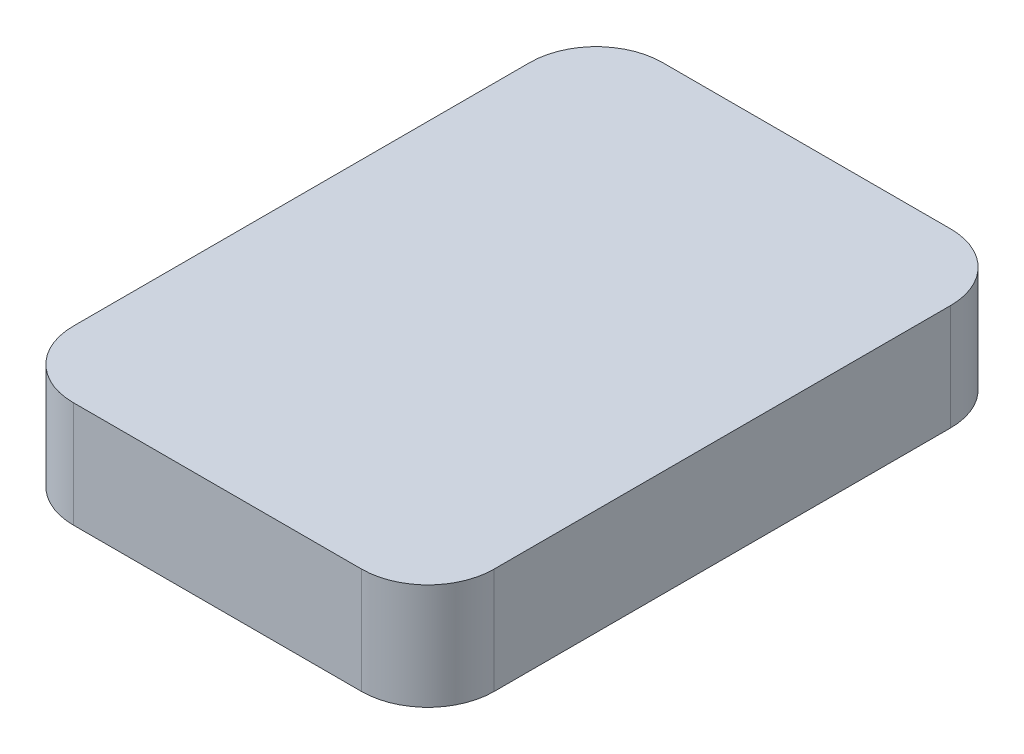
ISO-10303-21;
HEADER;
FILE_DESCRIPTION(('STEP AP214'),'2;1');
FILE_NAME('part.step','',(''),(''),'','','');
FILE_SCHEMA(('AUTOMOTIVE_DESIGN { 1 0 10303 214 1 1 1 1 }'));
ENDSEC;
DATA;
#1=APPLICATION_CONTEXT('core data for automotive mechanical design processes');
#2=APPLICATION_PROTOCOL_DEFINITION('international standard','automotive_design',2000,#1);
#3=PRODUCT_CONTEXT('',#1,'mechanical');
#4=PRODUCT('Part','Part','',(#3));
#5=PRODUCT_RELATED_PRODUCT_CATEGORY('part','',(#4));
#6=PRODUCT_DEFINITION_FORMATION('','',#4);
#7=PRODUCT_DEFINITION_CONTEXT('part definition',#1,'design');
#8=PRODUCT_DEFINITION('design','',#6,#7);
#9=PRODUCT_DEFINITION_SHAPE('','',#8);
#10=(LENGTH_UNIT() NAMED_UNIT(*) SI_UNIT(.MILLI.,.METRE.));
#11=(NAMED_UNIT(*) PLANE_ANGLE_UNIT() SI_UNIT($,.RADIAN.));
#12=(NAMED_UNIT(*) SI_UNIT($,.STERADIAN.) SOLID_ANGLE_UNIT());
#13=UNCERTAINTY_MEASURE_WITH_UNIT(LENGTH_MEASURE(1.E-05),#10,'distance_accuracy_value','');
#14=(GEOMETRIC_REPRESENTATION_CONTEXT(3) GLOBAL_UNCERTAINTY_ASSIGNED_CONTEXT((#13)) GLOBAL_UNIT_ASSIGNED_CONTEXT((#10,
#11,#12)) REPRESENTATION_CONTEXT('',''));
#15=CARTESIAN_POINT('',(0.,0.,0.));
#16=DIRECTION('',(0.,0.,1.));
#17=DIRECTION('',(1.,0.,0.));
#18=AXIS2_PLACEMENT_3D('',#15,#16,#17);
#19=CARTESIAN_POINT('',(31.75,16.,44.45));
#20=DIRECTION('',(-1.,0.,0.));
#21=DIRECTION('',(0.,0.,1.));
#22=AXIS2_PLACEMENT_3D('',#19,#20,#21);
#23=PLANE('',#22);
#24=DIRECTION('',(0.,0.,-1.));
#25=VECTOR('',#24,1.);
#26=CARTESIAN_POINT('',(31.75,16.,44.45));
#27=LINE('',#26,#25);
#28=CARTESIAN_POINT('',(31.75,16.,34.45));
#29=VERTEX_POINT('',#28);
#30=CARTESIAN_POINT('',(31.75,16.,-34.45));
#31=VERTEX_POINT('',#30);
#32=EDGE_CURVE('E119',#29,#31,#27,.T.);
#33=ORIENTED_EDGE('',*,*,#32,.F.);
#34=DIRECTION('',(0.,-1.,0.));
#35=VECTOR('',#34,1.);
#36=CARTESIAN_POINT('',(31.75,16.,34.45));
#37=LINE('',#36,#35);
#38=CARTESIAN_POINT('',(31.75,0.,34.45));
#39=VERTEX_POINT('',#38);
#40=EDGE_CURVE('E104',#29,#39,#37,.T.);
#41=ORIENTED_EDGE('',*,*,#40,.T.);
#42=DIRECTION('',(0.,0.,-1.));
#43=VECTOR('',#42,1.);
#44=CARTESIAN_POINT('',(31.75,0.,44.45));
#45=LINE('',#44,#43);
#46=CARTESIAN_POINT('',(31.75,0.,-34.45));
#47=VERTEX_POINT('',#46);
#48=EDGE_CURVE('E116',#39,#47,#45,.T.);
#49=ORIENTED_EDGE('',*,*,#48,.T.);
#50=DIRECTION('',(0.,-1.,0.));
#51=VECTOR('',#50,1.);
#52=CARTESIAN_POINT('',(31.75,16.,-34.45));
#53=LINE('',#52,#51);
#54=EDGE_CURVE('E121',#47,#31,#53,.F.);
#55=ORIENTED_EDGE('',*,*,#54,.T.);
#56=EDGE_LOOP('',(#33,#41,#49,#55));
#57=FACE_BOUND('',#56,.T.);
#58=ADVANCED_FACE('F34',(#57),#23,.F.);
#59=CARTESIAN_POINT('',(-31.75,16.,-44.45));
#60=DIRECTION('',(0.,0.,1.));
#61=DIRECTION('',(1.,0.,0.));
#62=AXIS2_PLACEMENT_3D('',#59,#60,#61);
#63=PLANE('',#62);
#64=DIRECTION('',(-1.,0.,0.));
#65=VECTOR('',#64,1.);
#66=CARTESIAN_POINT('',(-31.75,16.,-44.45));
#67=LINE('',#66,#65);
#68=CARTESIAN_POINT('',(21.75,16.,-44.45));
#69=VERTEX_POINT('',#68);
#70=CARTESIAN_POINT('',(-21.75,16.,-44.45));
#71=VERTEX_POINT('',#70);
#72=EDGE_CURVE('E161',#69,#71,#67,.T.);
#73=ORIENTED_EDGE('',*,*,#72,.F.);
#74=DIRECTION('',(0.,-1.,0.));
#75=VECTOR('',#74,1.);
#76=CARTESIAN_POINT('',(21.75,16.,-44.45));
#77=LINE('',#76,#75);
#78=CARTESIAN_POINT('',(21.75,0.,-44.45));
#79=VERTEX_POINT('',#78);
#80=EDGE_CURVE('E154',#69,#79,#77,.T.);
#81=ORIENTED_EDGE('',*,*,#80,.T.);
#82=DIRECTION('',(-1.,0.,0.));
#83=VECTOR('',#82,1.);
#84=CARTESIAN_POINT('',(-31.75,0.,-44.45));
#85=LINE('',#84,#83);
#86=CARTESIAN_POINT('',(-21.75,0.,-44.45));
#87=VERTEX_POINT('',#86);
#88=EDGE_CURVE('E125',#79,#87,#85,.T.);
#89=ORIENTED_EDGE('',*,*,#88,.T.);
#90=DIRECTION('',(0.,-1.,0.));
#91=VECTOR('',#90,1.);
#92=CARTESIAN_POINT('',(-21.75,16.,-44.45));
#93=LINE('',#92,#91);
#94=EDGE_CURVE('E152',#87,#71,#93,.F.);
#95=ORIENTED_EDGE('',*,*,#94,.T.);
#96=EDGE_LOOP('',(#73,#81,#89,#95));
#97=FACE_BOUND('',#96,.T.);
#98=ADVANCED_FACE('F159',(#97),#63,.F.);
#99=CARTESIAN_POINT('',(-31.75,16.,44.45));
#100=DIRECTION('',(1.,0.,0.));
#101=DIRECTION('',(0.,0.,-1.));
#102=AXIS2_PLACEMENT_3D('',#99,#100,#101);
#103=PLANE('',#102);
#104=DIRECTION('',(0.,0.,1.));
#105=VECTOR('',#104,1.);
#106=CARTESIAN_POINT('',(-31.75,16.,44.45));
#107=LINE('',#106,#105);
#108=CARTESIAN_POINT('',(-31.75,16.,-34.45));
#109=VERTEX_POINT('',#108);
#110=CARTESIAN_POINT('',(-31.75,16.,34.45));
#111=VERTEX_POINT('',#110);
#112=EDGE_CURVE('E169',#109,#111,#107,.T.);
#113=ORIENTED_EDGE('',*,*,#112,.F.);
#114=DIRECTION('',(0.,-1.,0.));
#115=VECTOR('',#114,1.);
#116=CARTESIAN_POINT('',(-31.75,16.,-34.45));
#117=LINE('',#116,#115);
#118=CARTESIAN_POINT('',(-31.75,0.,-34.45));
#119=VERTEX_POINT('',#118);
#120=EDGE_CURVE('E11',#109,#119,#117,.T.);
#121=ORIENTED_EDGE('',*,*,#120,.T.);
#122=DIRECTION('',(0.,0.,1.));
#123=VECTOR('',#122,1.);
#124=CARTESIAN_POINT('',(-31.75,0.,44.45));
#125=LINE('',#124,#123);
#126=CARTESIAN_POINT('',(-31.75,0.,34.45));
#127=VERTEX_POINT('',#126);
#128=EDGE_CURVE('E128',#119,#127,#125,.T.);
#129=ORIENTED_EDGE('',*,*,#128,.T.);
#130=DIRECTION('',(0.,-1.,0.));
#131=VECTOR('',#130,1.);
#132=CARTESIAN_POINT('',(-31.75,16.,34.45));
#133=LINE('',#132,#131);
#134=EDGE_CURVE('E42',#127,#111,#133,.F.);
#135=ORIENTED_EDGE('',*,*,#134,.T.);
#136=EDGE_LOOP('',(#113,#121,#129,#135));
#137=FACE_BOUND('',#136,.T.);
#138=ADVANCED_FACE('F168',(#137),#103,.F.);
#139=CARTESIAN_POINT('',(-31.75,16.,44.45));
#140=DIRECTION('',(0.,0.,-1.));
#141=DIRECTION('',(-1.,0.,0.));
#142=AXIS2_PLACEMENT_3D('',#139,#140,#141);
#143=PLANE('',#142);
#144=DIRECTION('',(1.,0.,0.));
#145=VECTOR('',#144,1.);
#146=CARTESIAN_POINT('',(-31.75,0.,44.45));
#147=LINE('',#146,#145);
#148=CARTESIAN_POINT('',(-21.75,0.,44.45));
#149=VERTEX_POINT('',#148);
#150=CARTESIAN_POINT('',(21.75,0.,44.45));
#151=VERTEX_POINT('',#150);
#152=EDGE_CURVE('E135',#149,#151,#147,.T.);
#153=ORIENTED_EDGE('',*,*,#152,.T.);
#154=DIRECTION('',(0.,-1.,0.));
#155=VECTOR('',#154,1.);
#156=CARTESIAN_POINT('',(21.75,16.,44.45));
#157=LINE('',#156,#155);
#158=CARTESIAN_POINT('',(21.75,16.,44.45));
#159=VERTEX_POINT('',#158);
#160=EDGE_CURVE('E105',#151,#159,#157,.F.);
#161=ORIENTED_EDGE('',*,*,#160,.T.);
#162=DIRECTION('',(1.,0.,0.));
#163=VECTOR('',#162,1.);
#164=CARTESIAN_POINT('',(-31.75,16.,44.45));
#165=LINE('',#164,#163);
#166=CARTESIAN_POINT('',(-21.75,16.,44.45));
#167=VERTEX_POINT('',#166);
#168=EDGE_CURVE('E131',#167,#159,#165,.T.);
#169=ORIENTED_EDGE('',*,*,#168,.F.);
#170=DIRECTION('',(0.,-1.,0.));
#171=VECTOR('',#170,1.);
#172=CARTESIAN_POINT('',(-21.75,16.,44.45));
#173=LINE('',#172,#171);
#174=EDGE_CURVE('E110',#167,#149,#173,.T.);
#175=ORIENTED_EDGE('',*,*,#174,.T.);
#176=EDGE_LOOP('',(#153,#161,#169,#175));
#177=FACE_BOUND('',#176,.T.);
#178=ADVANCED_FACE('F192',(#177),#143,.F.);
#179=CARTESIAN_POINT('',(0.,16.,0.));
#180=DIRECTION('',(0.,-1.,0.));
#181=DIRECTION('',(0.,0.,-1.));
#182=AXIS2_PLACEMENT_3D('',#179,#180,#181);
#183=PLANE('',#182);
#184=ORIENTED_EDGE('',*,*,#168,.T.);
#185=CARTESIAN_POINT('',(21.75,16.,34.45));
#186=DIRECTION('',(0.,-1.,0.));
#187=DIRECTION('',(0.,0.,-1.));
#188=AXIS2_PLACEMENT_3D('',#185,#186,#187);
#189=CIRCLE('',#188,10.);
#190=EDGE_CURVE('E150',#159,#29,#189,.F.);
#191=ORIENTED_EDGE('',*,*,#190,.T.);
#192=ORIENTED_EDGE('',*,*,#32,.T.);
#193=CARTESIAN_POINT('',(21.75,16.,-34.45));
#194=DIRECTION('',(0.,-1.,0.));
#195=DIRECTION('',(0.,0.,-1.));
#196=AXIS2_PLACEMENT_3D('',#193,#194,#195);
#197=CIRCLE('',#196,10.);
#198=EDGE_CURVE('E148',#31,#69,#197,.F.);
#199=ORIENTED_EDGE('',*,*,#198,.T.);
#200=ORIENTED_EDGE('',*,*,#72,.T.);
#201=CARTESIAN_POINT('',(-21.75,16.,-34.45));
#202=DIRECTION('',(0.,-1.,0.));
#203=DIRECTION('',(0.,0.,-1.));
#204=AXIS2_PLACEMENT_3D('',#201,#202,#203);
#205=CIRCLE('',#204,10.);
#206=EDGE_CURVE('E55',#71,#109,#205,.F.);
#207=ORIENTED_EDGE('',*,*,#206,.T.);
#208=ORIENTED_EDGE('',*,*,#112,.T.);
#209=CARTESIAN_POINT('',(-21.75,16.,34.45));
#210=DIRECTION('',(0.,-1.,0.));
#211=DIRECTION('',(0.,0.,-1.));
#212=AXIS2_PLACEMENT_3D('',#209,#210,#211);
#213=CIRCLE('',#212,10.);
#214=EDGE_CURVE('E145',#111,#167,#213,.F.);
#215=ORIENTED_EDGE('',*,*,#214,.T.);
#216=EDGE_LOOP('',(#184,#191,#192,#199,#200,#207,#208,#215));
#217=FACE_BOUND('',#216,.T.);
#218=ADVANCED_FACE('F174',(#217),#183,.F.);
#219=CARTESIAN_POINT('',(0.,0.,0.));
#220=DIRECTION('',(0.,-1.,0.));
#221=DIRECTION('',(0.,0.,-1.));
#222=AXIS2_PLACEMENT_3D('',#219,#220,#221);
#223=PLANE('',#222);
#224=ORIENTED_EDGE('',*,*,#48,.F.);
#225=CARTESIAN_POINT('',(21.75,0.,34.45));
#226=DIRECTION('',(0.,-1.,0.));
#227=DIRECTION('',(0.,0.,-1.));
#228=AXIS2_PLACEMENT_3D('',#225,#226,#227);
#229=CIRCLE('',#228,10.);
#230=EDGE_CURVE('E100',#39,#151,#229,.T.);
#231=ORIENTED_EDGE('',*,*,#230,.T.);
#232=ORIENTED_EDGE('',*,*,#152,.F.);
#233=CARTESIAN_POINT('',(-21.75,0.,34.45));
#234=DIRECTION('',(0.,-1.,0.));
#235=DIRECTION('',(0.,0.,-1.));
#236=AXIS2_PLACEMENT_3D('',#233,#234,#235);
#237=CIRCLE('',#236,10.);
#238=EDGE_CURVE('E120',#149,#127,#237,.T.);
#239=ORIENTED_EDGE('',*,*,#238,.T.);
#240=ORIENTED_EDGE('',*,*,#128,.F.);
#241=CARTESIAN_POINT('',(-21.75,0.,-34.45));
#242=DIRECTION('',(0.,-1.,0.));
#243=DIRECTION('',(0.,0.,-1.));
#244=AXIS2_PLACEMENT_3D('',#241,#242,#243);
#245=CIRCLE('',#244,10.);
#246=EDGE_CURVE('E139',#119,#87,#245,.T.);
#247=ORIENTED_EDGE('',*,*,#246,.T.);
#248=ORIENTED_EDGE('',*,*,#88,.F.);
#249=CARTESIAN_POINT('',(21.75,0.,-34.45));
#250=DIRECTION('',(0.,-1.,0.));
#251=DIRECTION('',(0.,0.,-1.));
#252=AXIS2_PLACEMENT_3D('',#249,#250,#251);
#253=CIRCLE('',#252,10.);
#254=EDGE_CURVE('E111',#79,#47,#253,.T.);
#255=ORIENTED_EDGE('',*,*,#254,.T.);
#256=EDGE_LOOP('',(#224,#231,#232,#239,#240,#247,#248,#255));
#257=FACE_BOUND('',#256,.T.);
#258=ADVANCED_FACE('F123',(#257),#223,.T.);
#259=CARTESIAN_POINT('',(21.75,16.,34.45));
#260=DIRECTION('',(0.,-1.,0.));
#261=DIRECTION('',(0.,0.,-1.));
#262=AXIS2_PLACEMENT_3D('',#259,#260,#261);
#263=CYLINDRICAL_SURFACE('',#262,10.);
#264=ORIENTED_EDGE('',*,*,#190,.F.);
#265=ORIENTED_EDGE('',*,*,#160,.F.);
#266=ORIENTED_EDGE('',*,*,#230,.F.);
#267=ORIENTED_EDGE('',*,*,#40,.F.);
#268=EDGE_LOOP('',(#264,#265,#266,#267));
#269=FACE_BOUND('',#268,.T.);
#270=ADVANCED_FACE('F103',(#269),#263,.T.);
#271=CARTESIAN_POINT('',(21.75,16.,-34.45));
#272=DIRECTION('',(0.,-1.,0.));
#273=DIRECTION('',(0.,0.,-1.));
#274=AXIS2_PLACEMENT_3D('',#271,#272,#273);
#275=CYLINDRICAL_SURFACE('',#274,10.);
#276=ORIENTED_EDGE('',*,*,#198,.F.);
#277=ORIENTED_EDGE('',*,*,#54,.F.);
#278=ORIENTED_EDGE('',*,*,#254,.F.);
#279=ORIENTED_EDGE('',*,*,#80,.F.);
#280=EDGE_LOOP('',(#276,#277,#278,#279));
#281=FACE_BOUND('',#280,.T.);
#282=ADVANCED_FACE('F175',(#281),#275,.T.);
#283=CARTESIAN_POINT('',(-21.75,16.,-34.45));
#284=DIRECTION('',(0.,-1.,0.));
#285=DIRECTION('',(0.,0.,-1.));
#286=AXIS2_PLACEMENT_3D('',#283,#284,#285);
#287=CYLINDRICAL_SURFACE('',#286,10.);
#288=ORIENTED_EDGE('',*,*,#206,.F.);
#289=ORIENTED_EDGE('',*,*,#94,.F.);
#290=ORIENTED_EDGE('',*,*,#246,.F.);
#291=ORIENTED_EDGE('',*,*,#120,.F.);
#292=EDGE_LOOP('',(#288,#289,#290,#291));
#293=FACE_BOUND('',#292,.T.);
#294=ADVANCED_FACE('F167',(#293),#287,.T.);
#295=CARTESIAN_POINT('',(-21.75,16.,34.45));
#296=DIRECTION('',(0.,-1.,0.));
#297=DIRECTION('',(0.,0.,-1.));
#298=AXIS2_PLACEMENT_3D('',#295,#296,#297);
#299=CYLINDRICAL_SURFACE('',#298,10.);
#300=ORIENTED_EDGE('',*,*,#214,.F.);
#301=ORIENTED_EDGE('',*,*,#134,.F.);
#302=ORIENTED_EDGE('',*,*,#238,.F.);
#303=ORIENTED_EDGE('',*,*,#174,.F.);
#304=EDGE_LOOP('',(#300,#301,#302,#303));
#305=FACE_BOUND('',#304,.T.);
#306=ADVANCED_FACE('F36',(#305),#299,.T.);
#307=CLOSED_SHELL('',(#58,#98,#138,#178,#218,#258,#270,#282,#294,#306));
#308=MANIFOLD_SOLID_BREP('B2',#307);
#309=ADVANCED_BREP_SHAPE_REPRESENTATION('',(#18,#308),#14);
#310=SHAPE_DEFINITION_REPRESENTATION(#9,#309);
ENDSEC;
END-ISO-10303-21;
